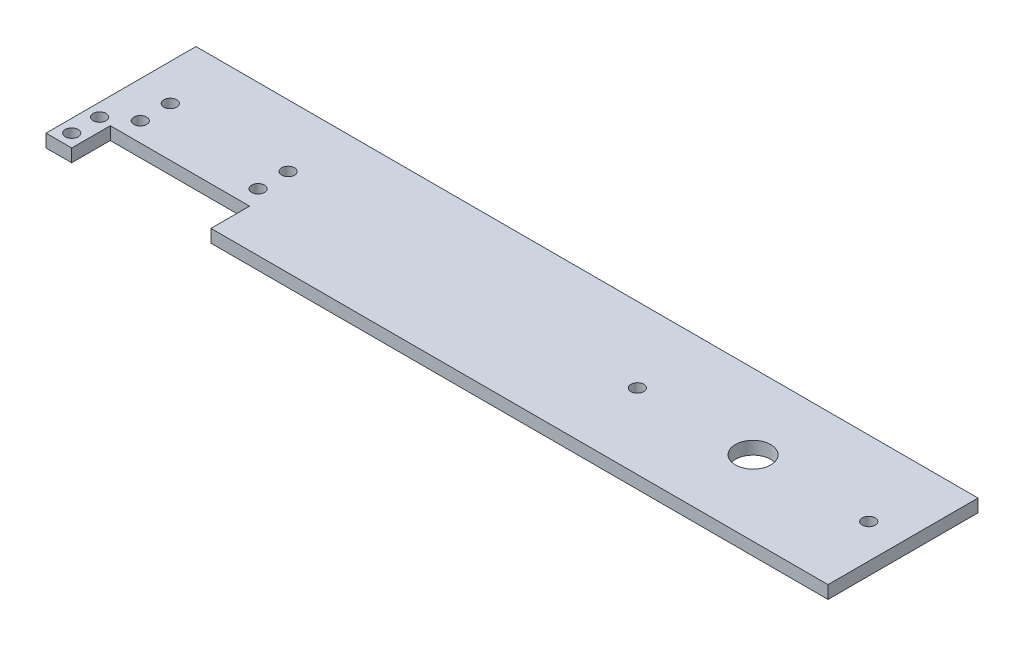
ISO-10303-21;
HEADER;
FILE_DESCRIPTION(('STEP AP214'),'2;1');
FILE_NAME('part.step','',(''),(''),'','','');
FILE_SCHEMA(('AUTOMOTIVE_DESIGN { 1 0 10303 214 1 1 1 1 }'));
ENDSEC;
DATA;
#1=APPLICATION_CONTEXT('core data for automotive mechanical design processes');
#2=APPLICATION_PROTOCOL_DEFINITION('international standard','automotive_design',2000,#1);
#3=PRODUCT_CONTEXT('',#1,'mechanical');
#4=PRODUCT('Part','Part','',(#3));
#5=PRODUCT_RELATED_PRODUCT_CATEGORY('part','',(#4));
#6=PRODUCT_DEFINITION_FORMATION('','',#4);
#7=PRODUCT_DEFINITION_CONTEXT('part definition',#1,'design');
#8=PRODUCT_DEFINITION('design','',#6,#7);
#9=PRODUCT_DEFINITION_SHAPE('','',#8);
#10=(LENGTH_UNIT() NAMED_UNIT(*) SI_UNIT(.MILLI.,.METRE.));
#11=(NAMED_UNIT(*) PLANE_ANGLE_UNIT() SI_UNIT($,.RADIAN.));
#12=(NAMED_UNIT(*) SI_UNIT($,.STERADIAN.) SOLID_ANGLE_UNIT());
#13=UNCERTAINTY_MEASURE_WITH_UNIT(LENGTH_MEASURE(1.E-05),#10,'distance_accuracy_value','');
#14=(GEOMETRIC_REPRESENTATION_CONTEXT(3) GLOBAL_UNCERTAINTY_ASSIGNED_CONTEXT((#13)) GLOBAL_UNIT_ASSIGNED_CONTEXT((#10,
#11,#12)) REPRESENTATION_CONTEXT('',''));
#15=CARTESIAN_POINT('',(0.,0.,0.));
#16=DIRECTION('',(0.,0.,1.));
#17=DIRECTION('',(1.,0.,0.));
#18=AXIS2_PLACEMENT_3D('',#15,#16,#17);
#19=CARTESIAN_POINT('',(0.,3.,12.5));
#20=DIRECTION('',(0.,0.,-1.));
#21=DIRECTION('',(-1.,0.,0.));
#22=AXIS2_PLACEMENT_3D('',#19,#20,#21);
#23=PLANE('',#22);
#24=DIRECTION('',(0.,1.,0.));
#25=VECTOR('',#24,1.);
#26=CARTESIAN_POINT('',(-94.,0.,12.5));
#27=LINE('',#26,#25);
#28=CARTESIAN_POINT('',(-94.,0.,12.5));
#29=VERTEX_POINT('',#28);
#30=CARTESIAN_POINT('',(-94.,3.,12.5));
#31=VERTEX_POINT('',#30);
#32=EDGE_CURVE('E111',#29,#31,#27,.T.);
#33=ORIENTED_EDGE('',*,*,#32,.T.);
#34=DIRECTION('',(1.,0.,0.));
#35=VECTOR('',#34,1.);
#36=CARTESIAN_POINT('',(0.,3.,12.5));
#37=LINE('',#36,#35);
#38=CARTESIAN_POINT('',(-100.,3.,12.5));
#39=VERTEX_POINT('',#38);
#40=EDGE_CURVE('E195',#39,#31,#37,.T.);
#41=ORIENTED_EDGE('',*,*,#40,.F.);
#42=DIRECTION('',(0.,-1.,0.));
#43=VECTOR('',#42,1.);
#44=CARTESIAN_POINT('',(-100.,3.,12.5));
#45=LINE('',#44,#43);
#46=CARTESIAN_POINT('',(-100.,0.,12.5));
#47=VERTEX_POINT('',#46);
#48=EDGE_CURVE('E129',#39,#47,#45,.T.);
#49=ORIENTED_EDGE('',*,*,#48,.T.);
#50=DIRECTION('',(1.,0.,0.));
#51=VECTOR('',#50,1.);
#52=CARTESIAN_POINT('',(0.,0.,12.5));
#53=LINE('',#52,#51);
#54=EDGE_CURVE('E126',#47,#29,#53,.T.);
#55=ORIENTED_EDGE('',*,*,#54,.T.);
#56=EDGE_LOOP('',(#33,#41,#49,#55));
#57=FACE_BOUND('',#56,.T.);
#58=ADVANCED_FACE('F37',(#57),#23,.F.);
#59=CARTESIAN_POINT('',(0.,3.,0.));
#60=DIRECTION('',(0.,1.,0.));
#61=DIRECTION('',(0.,0.,1.));
#62=AXIS2_PLACEMENT_3D('',#59,#60,#61);
#63=PLANE('',#62);
#64=CARTESIAN_POINT('',(-91.4999999999999,3.,-1.));
#65=DIRECTION('',(0.,1.,0.));
#66=DIRECTION('',(0.,0.,1.));
#67=AXIS2_PLACEMENT_3D('',#64,#65,#66);
#68=CIRCLE('',#67,1.5);
#69=CARTESIAN_POINT('',(-91.4999999999999,3.,0.499999999999995));
#70=VERTEX_POINT('',#69);
#71=EDGE_CURVE('E204',#70,#70,#68,.T.);
#72=ORIENTED_EDGE('',*,*,#71,.F.);
#73=EDGE_LOOP('',(#72));
#74=FACE_BOUND('',#73,.T.);
#75=CARTESIAN_POINT('',(-63.9999999999999,3.,-1.));
#76=DIRECTION('',(0.,1.,0.));
#77=DIRECTION('',(0.,0.,1.));
#78=AXIS2_PLACEMENT_3D('',#75,#76,#77);
#79=CIRCLE('',#78,1.5);
#80=CARTESIAN_POINT('',(-63.9999999999999,3.,0.499999999999994));
#81=VERTEX_POINT('',#80);
#82=EDGE_CURVE('E207',#81,#81,#79,.T.);
#83=ORIENTED_EDGE('',*,*,#82,.F.);
#84=EDGE_LOOP('',(#83));
#85=FACE_BOUND('',#84,.T.);
#86=CARTESIAN_POINT('',(-64.,3.,-8.));
#87=DIRECTION('',(0.,1.,0.));
#88=DIRECTION('',(0.,0.,1.));
#89=AXIS2_PLACEMENT_3D('',#86,#87,#88);
#90=CIRCLE('',#89,1.5);
#91=CARTESIAN_POINT('',(-64.,3.,-6.5));
#92=VERTEX_POINT('',#91);
#93=EDGE_CURVE('E210',#92,#92,#90,.T.);
#94=ORIENTED_EDGE('',*,*,#93,.F.);
#95=EDGE_LOOP('',(#94));
#96=FACE_BOUND('',#95,.T.);
#97=CARTESIAN_POINT('',(-91.5,3.,-8.));
#98=DIRECTION('',(0.,1.,0.));
#99=DIRECTION('',(0.,0.,1.));
#100=AXIS2_PLACEMENT_3D('',#97,#98,#99);
#101=CIRCLE('',#100,1.5);
#102=CARTESIAN_POINT('',(-91.5,3.,-6.5));
#103=VERTEX_POINT('',#102);
#104=EDGE_CURVE('E213',#103,#103,#101,.T.);
#105=ORIENTED_EDGE('',*,*,#104,.F.);
#106=EDGE_LOOP('',(#105));
#107=FACE_BOUND('',#106,.T.);
#108=CARTESIAN_POINT('',(-97.,3.,3.));
#109=DIRECTION('',(0.,1.,0.));
#110=DIRECTION('',(0.,0.,1.));
#111=AXIS2_PLACEMENT_3D('',#108,#109,#110);
#112=CIRCLE('',#111,1.5);
#113=CARTESIAN_POINT('',(-97.,3.,4.5));
#114=VERTEX_POINT('',#113);
#115=EDGE_CURVE('E216',#114,#114,#112,.T.);
#116=ORIENTED_EDGE('',*,*,#115,.F.);
#117=EDGE_LOOP('',(#116));
#118=FACE_BOUND('',#117,.T.);
#119=CARTESIAN_POINT('',(-97.,3.,9.5));
#120=DIRECTION('',(0.,1.,0.));
#121=DIRECTION('',(0.,0.,1.));
#122=AXIS2_PLACEMENT_3D('',#119,#120,#121);
#123=CIRCLE('',#122,1.5);
#124=CARTESIAN_POINT('',(-97.,3.,11.));
#125=VERTEX_POINT('',#124);
#126=EDGE_CURVE('E219',#125,#125,#123,.T.);
#127=ORIENTED_EDGE('',*,*,#126,.F.);
#128=EDGE_LOOP('',(#127));
#129=FACE_BOUND('',#128,.T.);
#130=CARTESIAN_POINT('',(47.5,3.,-5.));
#131=DIRECTION('',(0.,1.,0.));
#132=DIRECTION('',(0.,0.,1.));
#133=AXIS2_PLACEMENT_3D('',#130,#131,#132);
#134=CIRCLE('',#133,4.125);
#135=CARTESIAN_POINT('',(47.5,3.,-0.875000000000003));
#136=VERTEX_POINT('',#135);
#137=EDGE_CURVE('E222',#136,#136,#134,.T.);
#138=ORIENTED_EDGE('',*,*,#137,.F.);
#139=EDGE_LOOP('',(#138));
#140=FACE_BOUND('',#139,.T.);
#141=CARTESIAN_POINT('',(74.5,3.,-5.));
#142=DIRECTION('',(0.,1.,0.));
#143=DIRECTION('',(0.,0.,1.));
#144=AXIS2_PLACEMENT_3D('',#141,#142,#143);
#145=CIRCLE('',#144,1.5);
#146=CARTESIAN_POINT('',(74.5,3.,-3.5));
#147=VERTEX_POINT('',#146);
#148=EDGE_CURVE('E224',#147,#147,#145,.T.);
#149=ORIENTED_EDGE('',*,*,#148,.F.);
#150=EDGE_LOOP('',(#149));
#151=FACE_BOUND('',#150,.T.);
#152=CARTESIAN_POINT('',(20.5,3.,-4.99999999999999));
#153=DIRECTION('',(0.,1.,0.));
#154=DIRECTION('',(0.,0.,1.));
#155=AXIS2_PLACEMENT_3D('',#152,#153,#154);
#156=CIRCLE('',#155,1.5);
#157=CARTESIAN_POINT('',(20.5,3.,-3.49999999999999));
#158=VERTEX_POINT('',#157);
#159=EDGE_CURVE('E137',#158,#158,#156,.F.);
#160=ORIENTED_EDGE('',*,*,#159,.T.);
#161=EDGE_LOOP('',(#160));
#162=FACE_BOUND('',#161,.T.);
#163=ORIENTED_EDGE('',*,*,#40,.T.);
#164=DIRECTION('',(0.,0.,-1.));
#165=VECTOR('',#164,1.);
#166=CARTESIAN_POINT('',(-94.,3.,0.));
#167=LINE('',#166,#165);
#168=CARTESIAN_POINT('',(-94.,3.,3.5));
#169=VERTEX_POINT('',#168);
#170=EDGE_CURVE('E116',#31,#169,#167,.T.);
#171=ORIENTED_EDGE('',*,*,#170,.T.);
#172=DIRECTION('',(1.,0.,0.));
#173=VECTOR('',#172,1.);
#174=CARTESIAN_POINT('',(0.,3.,3.5));
#175=LINE('',#174,#173);
#176=CARTESIAN_POINT('',(-61.5,3.,3.5));
#177=VERTEX_POINT('',#176);
#178=EDGE_CURVE('E185',#169,#177,#175,.T.);
#179=ORIENTED_EDGE('',*,*,#178,.T.);
#180=DIRECTION('',(0.,0.,-1.));
#181=VECTOR('',#180,1.);
#182=CARTESIAN_POINT('',(-61.5,3.,0.));
#183=LINE('',#182,#181);
#184=CARTESIAN_POINT('',(-61.5,3.,12.5));
#185=VERTEX_POINT('',#184);
#186=EDGE_CURVE('E188',#185,#177,#183,.T.);
#187=ORIENTED_EDGE('',*,*,#186,.F.);
#188=CARTESIAN_POINT('',(82.5,3.,12.5));
#189=VERTEX_POINT('',#188);
#190=EDGE_CURVE('E88',#185,#189,#37,.T.);
#191=ORIENTED_EDGE('',*,*,#190,.T.);
#192=DIRECTION('',(0.,0.,1.));
#193=VECTOR('',#192,1.);
#194=CARTESIAN_POINT('',(82.5,3.,0.));
#195=LINE('',#194,#193);
#196=CARTESIAN_POINT('',(82.5,3.,-22.5));
#197=VERTEX_POINT('',#196);
#198=EDGE_CURVE('E197',#197,#189,#195,.T.);
#199=ORIENTED_EDGE('',*,*,#198,.F.);
#200=DIRECTION('',(1.,0.,0.));
#201=VECTOR('',#200,1.);
#202=CARTESIAN_POINT('',(0.,3.,-22.5));
#203=LINE('',#202,#201);
#204=CARTESIAN_POINT('',(-100.,3.,-22.5));
#205=VERTEX_POINT('',#204);
#206=EDGE_CURVE('E200',#205,#197,#203,.T.);
#207=ORIENTED_EDGE('',*,*,#206,.F.);
#208=DIRECTION('',(0.,0.,1.));
#209=VECTOR('',#208,1.);
#210=CARTESIAN_POINT('',(-100.,3.,0.));
#211=LINE('',#210,#209);
#212=EDGE_CURVE('E60',#205,#39,#211,.T.);
#213=ORIENTED_EDGE('',*,*,#212,.T.);
#214=EDGE_LOOP('',(#163,#171,#179,#187,#191,#199,#207,#213));
#215=FACE_BOUND('',#214,.T.);
#216=ADVANCED_FACE('F231',(#74,#85,#96,#107,#118,#129,#140,#151,#162,#215),#63,.T.);
#217=CARTESIAN_POINT('',(0.,0.,0.));
#218=DIRECTION('',(0.,1.,0.));
#219=DIRECTION('',(0.,0.,1.));
#220=AXIS2_PLACEMENT_3D('',#217,#218,#219);
#221=PLANE('',#220);
#222=CARTESIAN_POINT('',(20.5,0.,-4.99999999999999));
#223=DIRECTION('',(0.,1.,0.));
#224=DIRECTION('',(0.,0.,1.));
#225=AXIS2_PLACEMENT_3D('',#222,#223,#224);
#226=CIRCLE('',#225,1.5);
#227=CARTESIAN_POINT('',(20.5,0.,-3.49999999999999));
#228=VERTEX_POINT('',#227);
#229=EDGE_CURVE('E167',#228,#228,#226,.F.);
#230=ORIENTED_EDGE('',*,*,#229,.F.);
#231=EDGE_LOOP('',(#230));
#232=FACE_BOUND('',#231,.T.);
#233=CARTESIAN_POINT('',(74.5,0.,-5.));
#234=DIRECTION('',(0.,1.,0.));
#235=DIRECTION('',(0.,0.,1.));
#236=AXIS2_PLACEMENT_3D('',#233,#234,#235);
#237=CIRCLE('',#236,1.5);
#238=CARTESIAN_POINT('',(74.5,0.,-3.5));
#239=VERTEX_POINT('',#238);
#240=EDGE_CURVE('E164',#239,#239,#237,.T.);
#241=ORIENTED_EDGE('',*,*,#240,.T.);
#242=EDGE_LOOP('',(#241));
#243=FACE_BOUND('',#242,.T.);
#244=CARTESIAN_POINT('',(47.5,0.,-5.));
#245=DIRECTION('',(0.,1.,0.));
#246=DIRECTION('',(0.,0.,1.));
#247=AXIS2_PLACEMENT_3D('',#244,#245,#246);
#248=CIRCLE('',#247,4.125);
#249=CARTESIAN_POINT('',(47.5,0.,-0.875000000000003));
#250=VERTEX_POINT('',#249);
#251=EDGE_CURVE('E161',#250,#250,#248,.T.);
#252=ORIENTED_EDGE('',*,*,#251,.T.);
#253=EDGE_LOOP('',(#252));
#254=FACE_BOUND('',#253,.T.);
#255=CARTESIAN_POINT('',(-97.,0.,9.5));
#256=DIRECTION('',(0.,1.,0.));
#257=DIRECTION('',(0.,0.,1.));
#258=AXIS2_PLACEMENT_3D('',#255,#256,#257);
#259=CIRCLE('',#258,1.5);
#260=CARTESIAN_POINT('',(-97.,0.,11.));
#261=VERTEX_POINT('',#260);
#262=EDGE_CURVE('E158',#261,#261,#259,.T.);
#263=ORIENTED_EDGE('',*,*,#262,.T.);
#264=EDGE_LOOP('',(#263));
#265=FACE_BOUND('',#264,.T.);
#266=CARTESIAN_POINT('',(-97.,0.,3.));
#267=DIRECTION('',(0.,1.,0.));
#268=DIRECTION('',(0.,0.,1.));
#269=AXIS2_PLACEMENT_3D('',#266,#267,#268);
#270=CIRCLE('',#269,1.5);
#271=CARTESIAN_POINT('',(-97.,0.,4.5));
#272=VERTEX_POINT('',#271);
#273=EDGE_CURVE('E155',#272,#272,#270,.T.);
#274=ORIENTED_EDGE('',*,*,#273,.T.);
#275=EDGE_LOOP('',(#274));
#276=FACE_BOUND('',#275,.T.);
#277=CARTESIAN_POINT('',(-91.5,0.,-8.));
#278=DIRECTION('',(0.,1.,0.));
#279=DIRECTION('',(0.,0.,1.));
#280=AXIS2_PLACEMENT_3D('',#277,#278,#279);
#281=CIRCLE('',#280,1.5);
#282=CARTESIAN_POINT('',(-91.5,0.,-6.5));
#283=VERTEX_POINT('',#282);
#284=EDGE_CURVE('E152',#283,#283,#281,.T.);
#285=ORIENTED_EDGE('',*,*,#284,.T.);
#286=EDGE_LOOP('',(#285));
#287=FACE_BOUND('',#286,.T.);
#288=CARTESIAN_POINT('',(-64.,0.,-8.));
#289=DIRECTION('',(0.,1.,0.));
#290=DIRECTION('',(0.,0.,1.));
#291=AXIS2_PLACEMENT_3D('',#288,#289,#290);
#292=CIRCLE('',#291,1.5);
#293=CARTESIAN_POINT('',(-64.,0.,-6.5));
#294=VERTEX_POINT('',#293);
#295=EDGE_CURVE('E149',#294,#294,#292,.T.);
#296=ORIENTED_EDGE('',*,*,#295,.T.);
#297=EDGE_LOOP('',(#296));
#298=FACE_BOUND('',#297,.T.);
#299=CARTESIAN_POINT('',(-63.9999999999999,0.,-1.));
#300=DIRECTION('',(0.,1.,0.));
#301=DIRECTION('',(0.,0.,1.));
#302=AXIS2_PLACEMENT_3D('',#299,#300,#301);
#303=CIRCLE('',#302,1.5);
#304=CARTESIAN_POINT('',(-63.9999999999999,0.,0.499999999999994));
#305=VERTEX_POINT('',#304);
#306=EDGE_CURVE('E146',#305,#305,#303,.T.);
#307=ORIENTED_EDGE('',*,*,#306,.T.);
#308=EDGE_LOOP('',(#307));
#309=FACE_BOUND('',#308,.T.);
#310=CARTESIAN_POINT('',(-91.4999999999999,0.,-1.));
#311=DIRECTION('',(0.,1.,0.));
#312=DIRECTION('',(0.,0.,1.));
#313=AXIS2_PLACEMENT_3D('',#310,#311,#312);
#314=CIRCLE('',#313,1.5);
#315=CARTESIAN_POINT('',(-91.4999999999999,0.,0.499999999999995));
#316=VERTEX_POINT('',#315);
#317=EDGE_CURVE('E143',#316,#316,#314,.T.);
#318=ORIENTED_EDGE('',*,*,#317,.T.);
#319=EDGE_LOOP('',(#318));
#320=FACE_BOUND('',#319,.T.);
#321=DIRECTION('',(0.,0.,-1.));
#322=VECTOR('',#321,1.);
#323=CARTESIAN_POINT('',(-94.,0.,0.));
#324=LINE('',#323,#322);
#325=CARTESIAN_POINT('',(-94.,0.,3.5));
#326=VERTEX_POINT('',#325);
#327=EDGE_CURVE('E11',#29,#326,#324,.T.);
#328=ORIENTED_EDGE('',*,*,#327,.F.);
#329=ORIENTED_EDGE('',*,*,#54,.F.);
#330=DIRECTION('',(0.,0.,1.));
#331=VECTOR('',#330,1.);
#332=CARTESIAN_POINT('',(-100.,0.,0.));
#333=LINE('',#332,#331);
#334=CARTESIAN_POINT('',(-100.,0.,-22.5));
#335=VERTEX_POINT('',#334);
#336=EDGE_CURVE('E81',#335,#47,#333,.T.);
#337=ORIENTED_EDGE('',*,*,#336,.F.);
#338=DIRECTION('',(1.,0.,0.));
#339=VECTOR('',#338,1.);
#340=CARTESIAN_POINT('',(0.,0.,-22.5));
#341=LINE('',#340,#339);
#342=CARTESIAN_POINT('',(82.5,0.,-22.5));
#343=VERTEX_POINT('',#342);
#344=EDGE_CURVE('E134',#335,#343,#341,.T.);
#345=ORIENTED_EDGE('',*,*,#344,.T.);
#346=DIRECTION('',(0.,0.,1.));
#347=VECTOR('',#346,1.);
#348=CARTESIAN_POINT('',(82.5,0.,0.));
#349=LINE('',#348,#347);
#350=CARTESIAN_POINT('',(82.5,0.,12.5));
#351=VERTEX_POINT('',#350);
#352=EDGE_CURVE('E130',#343,#351,#349,.T.);
#353=ORIENTED_EDGE('',*,*,#352,.T.);
#354=CARTESIAN_POINT('',(-61.5,0.,12.5));
#355=VERTEX_POINT('',#354);
#356=EDGE_CURVE('E131',#355,#351,#53,.T.);
#357=ORIENTED_EDGE('',*,*,#356,.F.);
#358=DIRECTION('',(0.,0.,-1.));
#359=VECTOR('',#358,1.);
#360=CARTESIAN_POINT('',(-61.5,0.,0.));
#361=LINE('',#360,#359);
#362=CARTESIAN_POINT('',(-61.5,0.,3.5));
#363=VERTEX_POINT('',#362);
#364=EDGE_CURVE('E45',#355,#363,#361,.T.);
#365=ORIENTED_EDGE('',*,*,#364,.T.);
#366=DIRECTION('',(1.,0.,0.));
#367=VECTOR('',#366,1.);
#368=CARTESIAN_POINT('',(0.,0.,3.5));
#369=LINE('',#368,#367);
#370=EDGE_CURVE('E128',#326,#363,#369,.T.);
#371=ORIENTED_EDGE('',*,*,#370,.F.);
#372=EDGE_LOOP('',(#328,#329,#337,#345,#353,#357,#365,#371));
#373=FACE_BOUND('',#372,.T.);
#374=ADVANCED_FACE('F125',(#232,#243,#254,#265,#276,#287,#298,#309,#320,#373),#221,.F.);
#375=ORIENTED_EDGE('',*,*,#190,.F.);
#376=DIRECTION('',(0.,1.,0.));
#377=VECTOR('',#376,1.);
#378=CARTESIAN_POINT('',(-61.5,0.,12.5));
#379=LINE('',#378,#377);
#380=EDGE_CURVE('E120',#355,#185,#379,.T.);
#381=ORIENTED_EDGE('',*,*,#380,.F.);
#382=ORIENTED_EDGE('',*,*,#356,.T.);
#383=DIRECTION('',(0.,-1.,0.));
#384=VECTOR('',#383,1.);
#385=CARTESIAN_POINT('',(82.5,3.,12.5));
#386=LINE('',#385,#384);
#387=EDGE_CURVE('E175',#189,#351,#386,.T.);
#388=ORIENTED_EDGE('',*,*,#387,.F.);
#389=EDGE_LOOP('',(#375,#381,#382,#388));
#390=FACE_BOUND('',#389,.T.);
#391=ADVANCED_FACE('F39',(#390),#23,.F.);
#392=CARTESIAN_POINT('',(82.5,3.,0.));
#393=DIRECTION('',(1.,0.,0.));
#394=DIRECTION('',(0.,0.,-1.));
#395=AXIS2_PLACEMENT_3D('',#392,#393,#394);
#396=PLANE('',#395);
#397=ORIENTED_EDGE('',*,*,#352,.F.);
#398=DIRECTION('',(0.,-1.,0.));
#399=VECTOR('',#398,1.);
#400=CARTESIAN_POINT('',(82.5,3.,-22.5));
#401=LINE('',#400,#399);
#402=EDGE_CURVE('E173',#197,#343,#401,.T.);
#403=ORIENTED_EDGE('',*,*,#402,.F.);
#404=ORIENTED_EDGE('',*,*,#198,.T.);
#405=ORIENTED_EDGE('',*,*,#387,.T.);
#406=EDGE_LOOP('',(#397,#403,#404,#405));
#407=FACE_BOUND('',#406,.T.);
#408=ADVANCED_FACE('F279',(#407),#396,.T.);
#409=CARTESIAN_POINT('',(0.,3.,-22.5));
#410=DIRECTION('',(0.,0.,-1.));
#411=DIRECTION('',(-1.,0.,0.));
#412=AXIS2_PLACEMENT_3D('',#409,#410,#411);
#413=PLANE('',#412);
#414=ORIENTED_EDGE('',*,*,#344,.F.);
#415=DIRECTION('',(0.,-1.,0.));
#416=VECTOR('',#415,1.);
#417=CARTESIAN_POINT('',(-100.,3.,-22.5));
#418=LINE('',#417,#416);
#419=EDGE_CURVE('E171',#205,#335,#418,.T.);
#420=ORIENTED_EDGE('',*,*,#419,.F.);
#421=ORIENTED_EDGE('',*,*,#206,.T.);
#422=ORIENTED_EDGE('',*,*,#402,.T.);
#423=EDGE_LOOP('',(#414,#420,#421,#422));
#424=FACE_BOUND('',#423,.T.);
#425=ADVANCED_FACE('F283',(#424),#413,.T.);
#426=CARTESIAN_POINT('',(74.5,3.,-5.));
#427=DIRECTION('',(0.,-1.,0.));
#428=DIRECTION('',(0.,0.,-1.));
#429=AXIS2_PLACEMENT_3D('',#426,#427,#428);
#430=CYLINDRICAL_SURFACE('',#429,1.5);
#431=ORIENTED_EDGE('',*,*,#148,.T.);
#432=EDGE_LOOP('',(#431));
#433=FACE_BOUND('',#432,.T.);
#434=ORIENTED_EDGE('',*,*,#240,.F.);
#435=EDGE_LOOP('',(#434));
#436=FACE_BOUND('',#435,.T.);
#437=ADVANCED_FACE('F288',(#433,#436),#430,.F.);
#438=CARTESIAN_POINT('',(47.5,3.,-5.));
#439=DIRECTION('',(0.,-1.,0.));
#440=DIRECTION('',(0.,0.,-1.));
#441=AXIS2_PLACEMENT_3D('',#438,#439,#440);
#442=CYLINDRICAL_SURFACE('',#441,4.125);
#443=ORIENTED_EDGE('',*,*,#137,.T.);
#444=EDGE_LOOP('',(#443));
#445=FACE_BOUND('',#444,.T.);
#446=ORIENTED_EDGE('',*,*,#251,.F.);
#447=EDGE_LOOP('',(#446));
#448=FACE_BOUND('',#447,.T.);
#449=ADVANCED_FACE('F305',(#445,#448),#442,.F.);
#450=CARTESIAN_POINT('',(-97.,3.,9.5));
#451=DIRECTION('',(0.,-1.,0.));
#452=DIRECTION('',(0.,0.,-1.));
#453=AXIS2_PLACEMENT_3D('',#450,#451,#452);
#454=CYLINDRICAL_SURFACE('',#453,1.5);
#455=ORIENTED_EDGE('',*,*,#126,.T.);
#456=EDGE_LOOP('',(#455));
#457=FACE_BOUND('',#456,.T.);
#458=ORIENTED_EDGE('',*,*,#262,.F.);
#459=EDGE_LOOP('',(#458));
#460=FACE_BOUND('',#459,.T.);
#461=ADVANCED_FACE('F308',(#457,#460),#454,.F.);
#462=CARTESIAN_POINT('',(-97.,3.,3.));
#463=DIRECTION('',(0.,-1.,0.));
#464=DIRECTION('',(0.,0.,-1.));
#465=AXIS2_PLACEMENT_3D('',#462,#463,#464);
#466=CYLINDRICAL_SURFACE('',#465,1.5);
#467=ORIENTED_EDGE('',*,*,#115,.T.);
#468=EDGE_LOOP('',(#467));
#469=FACE_BOUND('',#468,.T.);
#470=ORIENTED_EDGE('',*,*,#273,.F.);
#471=EDGE_LOOP('',(#470));
#472=FACE_BOUND('',#471,.T.);
#473=ADVANCED_FACE('F312',(#469,#472),#466,.F.);
#474=CARTESIAN_POINT('',(-91.5,3.,-8.));
#475=DIRECTION('',(0.,-1.,0.));
#476=DIRECTION('',(0.,0.,-1.));
#477=AXIS2_PLACEMENT_3D('',#474,#475,#476);
#478=CYLINDRICAL_SURFACE('',#477,1.5);
#479=ORIENTED_EDGE('',*,*,#104,.T.);
#480=EDGE_LOOP('',(#479));
#481=FACE_BOUND('',#480,.T.);
#482=ORIENTED_EDGE('',*,*,#284,.F.);
#483=EDGE_LOOP('',(#482));
#484=FACE_BOUND('',#483,.T.);
#485=ADVANCED_FACE('F316',(#481,#484),#478,.F.);
#486=CARTESIAN_POINT('',(-64.,3.,-8.));
#487=DIRECTION('',(0.,-1.,0.));
#488=DIRECTION('',(0.,0.,-1.));
#489=AXIS2_PLACEMENT_3D('',#486,#487,#488);
#490=CYLINDRICAL_SURFACE('',#489,1.5);
#491=ORIENTED_EDGE('',*,*,#93,.T.);
#492=EDGE_LOOP('',(#491));
#493=FACE_BOUND('',#492,.T.);
#494=ORIENTED_EDGE('',*,*,#295,.F.);
#495=EDGE_LOOP('',(#494));
#496=FACE_BOUND('',#495,.T.);
#497=ADVANCED_FACE('F269',(#493,#496),#490,.F.);
#498=CARTESIAN_POINT('',(-63.9999999999999,3.,-1.));
#499=DIRECTION('',(0.,-1.,0.));
#500=DIRECTION('',(0.,0.,-1.));
#501=AXIS2_PLACEMENT_3D('',#498,#499,#500);
#502=CYLINDRICAL_SURFACE('',#501,1.5);
#503=ORIENTED_EDGE('',*,*,#82,.T.);
#504=EDGE_LOOP('',(#503));
#505=FACE_BOUND('',#504,.T.);
#506=ORIENTED_EDGE('',*,*,#306,.F.);
#507=EDGE_LOOP('',(#506));
#508=FACE_BOUND('',#507,.T.);
#509=ADVANCED_FACE('F261',(#505,#508),#502,.F.);
#510=CARTESIAN_POINT('',(-91.4999999999999,3.,-1.));
#511=DIRECTION('',(0.,-1.,0.));
#512=DIRECTION('',(0.,0.,-1.));
#513=AXIS2_PLACEMENT_3D('',#510,#511,#512);
#514=CYLINDRICAL_SURFACE('',#513,1.5);
#515=ORIENTED_EDGE('',*,*,#71,.T.);
#516=EDGE_LOOP('',(#515));
#517=FACE_BOUND('',#516,.T.);
#518=ORIENTED_EDGE('',*,*,#317,.F.);
#519=EDGE_LOOP('',(#518));
#520=FACE_BOUND('',#519,.T.);
#521=ADVANCED_FACE('F259',(#517,#520),#514,.F.);
#522=CARTESIAN_POINT('',(-100.,3.,0.));
#523=DIRECTION('',(1.,0.,0.));
#524=DIRECTION('',(0.,0.,-1.));
#525=AXIS2_PLACEMENT_3D('',#522,#523,#524);
#526=PLANE('',#525);
#527=ORIENTED_EDGE('',*,*,#336,.T.);
#528=ORIENTED_EDGE('',*,*,#48,.F.);
#529=ORIENTED_EDGE('',*,*,#212,.F.);
#530=ORIENTED_EDGE('',*,*,#419,.T.);
#531=EDGE_LOOP('',(#527,#528,#529,#530));
#532=FACE_BOUND('',#531,.T.);
#533=ADVANCED_FACE('F236',(#532),#526,.F.);
#534=CARTESIAN_POINT('',(20.5,3.,-4.99999999999999));
#535=DIRECTION('',(0.,-1.,0.));
#536=DIRECTION('',(0.,0.,-1.));
#537=AXIS2_PLACEMENT_3D('',#534,#535,#536);
#538=CYLINDRICAL_SURFACE('',#537,1.5);
#539=ORIENTED_EDGE('',*,*,#159,.F.);
#540=EDGE_LOOP('',(#539));
#541=FACE_BOUND('',#540,.T.);
#542=ORIENTED_EDGE('',*,*,#229,.T.);
#543=EDGE_LOOP('',(#542));
#544=FACE_BOUND('',#543,.T.);
#545=ADVANCED_FACE('F233',(#541,#544),#538,.F.);
#546=CARTESIAN_POINT('',(-94.,0.,46.4737806416799));
#547=DIRECTION('',(1.,0.,0.));
#548=DIRECTION('',(0.,0.,-1.));
#549=AXIS2_PLACEMENT_3D('',#546,#547,#548);
#550=PLANE('',#549);
#551=ORIENTED_EDGE('',*,*,#32,.F.);
#552=ORIENTED_EDGE('',*,*,#327,.T.);
#553=DIRECTION('',(0.,-1.,0.));
#554=VECTOR('',#553,1.);
#555=CARTESIAN_POINT('',(-94.,0.,3.5));
#556=LINE('',#555,#554);
#557=EDGE_CURVE('E52',#169,#326,#556,.T.);
#558=ORIENTED_EDGE('',*,*,#557,.F.);
#559=ORIENTED_EDGE('',*,*,#170,.F.);
#560=EDGE_LOOP('',(#551,#552,#558,#559));
#561=FACE_BOUND('',#560,.T.);
#562=ADVANCED_FACE('F113',(#561),#550,.T.);
#563=CARTESIAN_POINT('',(-61.5,0.,46.4737806416799));
#564=DIRECTION('',(1.,0.,0.));
#565=DIRECTION('',(0.,0.,-1.));
#566=AXIS2_PLACEMENT_3D('',#563,#564,#565);
#567=PLANE('',#566);
#568=ORIENTED_EDGE('',*,*,#186,.T.);
#569=DIRECTION('',(0.,-1.,0.));
#570=VECTOR('',#569,1.);
#571=CARTESIAN_POINT('',(-61.5,0.,3.5));
#572=LINE('',#571,#570);
#573=EDGE_CURVE('E121',#177,#363,#572,.T.);
#574=ORIENTED_EDGE('',*,*,#573,.T.);
#575=ORIENTED_EDGE('',*,*,#364,.F.);
#576=ORIENTED_EDGE('',*,*,#380,.T.);
#577=EDGE_LOOP('',(#568,#574,#575,#576));
#578=FACE_BOUND('',#577,.T.);
#579=ADVANCED_FACE('F182',(#578),#567,.F.);
#580=CARTESIAN_POINT('',(0.,0.,3.5));
#581=DIRECTION('',(0.,0.,1.));
#582=DIRECTION('',(1.,0.,0.));
#583=AXIS2_PLACEMENT_3D('',#580,#581,#582);
#584=PLANE('',#583);
#585=ORIENTED_EDGE('',*,*,#557,.T.);
#586=ORIENTED_EDGE('',*,*,#370,.T.);
#587=ORIENTED_EDGE('',*,*,#573,.F.);
#588=ORIENTED_EDGE('',*,*,#178,.F.);
#589=EDGE_LOOP('',(#585,#586,#587,#588));
#590=FACE_BOUND('',#589,.T.);
#591=ADVANCED_FACE('F293',(#590),#584,.T.);
#592=CLOSED_SHELL('',(#58,#216,#374,#391,#408,#425,#437,#449,#461,#473,#485,#497,#509,#521,#533,
#545,#562,#579,#591));
#593=MANIFOLD_SOLID_BREP('B2',#592);
#594=ADVANCED_BREP_SHAPE_REPRESENTATION('',(#18,#593),#14);
#595=SHAPE_DEFINITION_REPRESENTATION(#9,#594);
ENDSEC;
END-ISO-10303-21;
